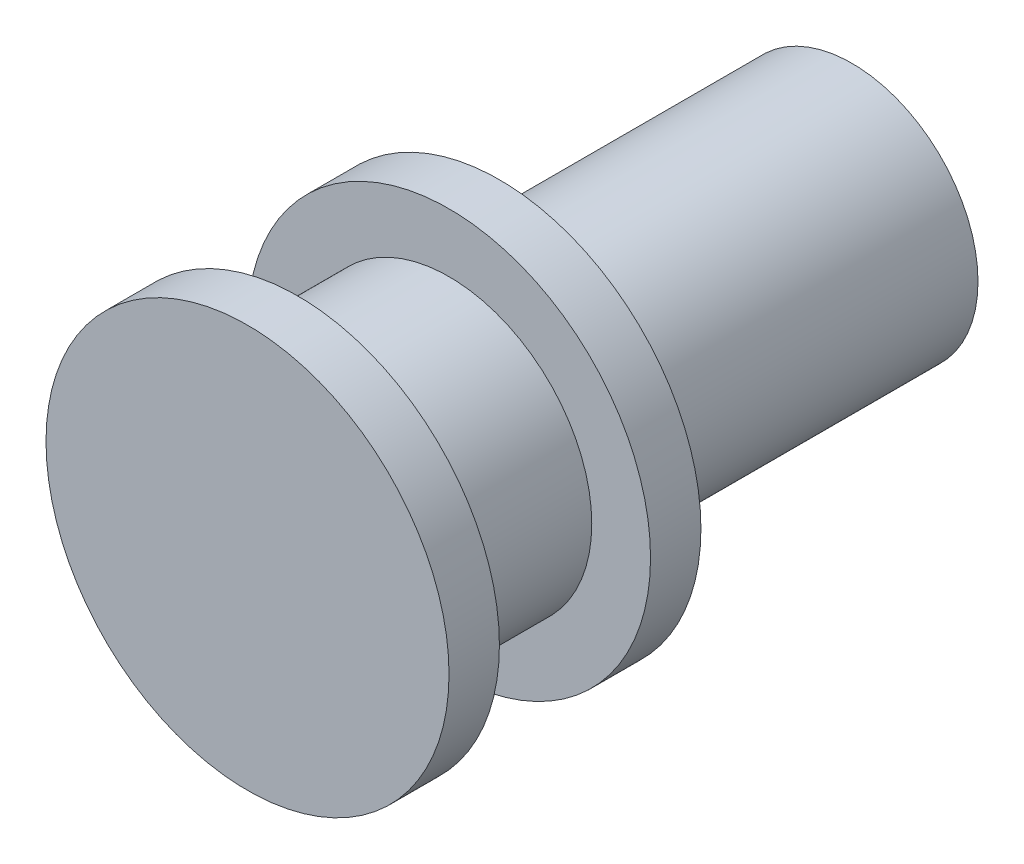
ISO-10303-21;
HEADER;
FILE_DESCRIPTION(('STEP AP214'),'2;1');
FILE_NAME('part.step','',(''),(''),'','','');
FILE_SCHEMA(('AUTOMOTIVE_DESIGN { 1 0 10303 214 1 1 1 1 }'));
ENDSEC;
DATA;
#1=APPLICATION_CONTEXT('core data for automotive mechanical design processes');
#2=APPLICATION_PROTOCOL_DEFINITION('international standard','automotive_design',2000,#1);
#3=PRODUCT_CONTEXT('',#1,'mechanical');
#4=PRODUCT('Part','Part','',(#3));
#5=PRODUCT_RELATED_PRODUCT_CATEGORY('part','',(#4));
#6=PRODUCT_DEFINITION_FORMATION('','',#4);
#7=PRODUCT_DEFINITION_CONTEXT('part definition',#1,'design');
#8=PRODUCT_DEFINITION('design','',#6,#7);
#9=PRODUCT_DEFINITION_SHAPE('','',#8);
#10=(LENGTH_UNIT() NAMED_UNIT(*) SI_UNIT(.MILLI.,.METRE.));
#11=(NAMED_UNIT(*) PLANE_ANGLE_UNIT() SI_UNIT($,.RADIAN.));
#12=(NAMED_UNIT(*) SI_UNIT($,.STERADIAN.) SOLID_ANGLE_UNIT());
#13=UNCERTAINTY_MEASURE_WITH_UNIT(LENGTH_MEASURE(1.E-05),#10,'distance_accuracy_value','');
#14=(GEOMETRIC_REPRESENTATION_CONTEXT(3) GLOBAL_UNCERTAINTY_ASSIGNED_CONTEXT((#13)) GLOBAL_UNIT_ASSIGNED_CONTEXT((#10,
#11,#12)) REPRESENTATION_CONTEXT('',''));
#15=CARTESIAN_POINT('',(0.,0.,0.));
#16=DIRECTION('',(0.,0.,1.));
#17=DIRECTION('',(1.,0.,0.));
#18=AXIS2_PLACEMENT_3D('',#15,#16,#17);
#19=CARTESIAN_POINT('',(0.,0.,0.));
#20=DIRECTION('',(0.,0.,-1.));
#21=DIRECTION('',(-1.,0.,0.));
#22=AXIS2_PLACEMENT_3D('',#19,#20,#21);
#23=PLANE('',#22);
#24=CARTESIAN_POINT('',(0.,0.,0.));
#25=DIRECTION('',(0.,0.,1.));
#26=DIRECTION('',(1.,0.,0.));
#27=AXIS2_PLACEMENT_3D('',#24,#25,#26);
#28=CIRCLE('',#27,3.048);
#29=CARTESIAN_POINT('',(3.048,0.,0.));
#30=VERTEX_POINT('',#29);
#31=EDGE_CURVE('E10',#30,#30,#28,.T.);
#32=ORIENTED_EDGE('',*,*,#31,.T.);
#33=EDGE_LOOP('',(#32));
#34=FACE_BOUND('',#33,.T.);
#35=ADVANCED_FACE('F35',(#34),#23,.F.);
#36=CARTESIAN_POINT('',(0.,0.,2.45094512195122));
#37=DIRECTION('',(0.,0.,1.));
#38=DIRECTION('',(1.,0.,0.));
#39=AXIS2_PLACEMENT_3D('',#36,#37,#38);
#40=CYLINDRICAL_SURFACE('',#39,3.048);
#41=ORIENTED_EDGE('',*,*,#31,.F.);
#42=EDGE_LOOP('',(#41));
#43=FACE_BOUND('',#42,.T.);
#44=CARTESIAN_POINT('',(0.,0.,-0.762));
#45=DIRECTION('',(0.,0.,1.));
#46=DIRECTION('',(1.,0.,0.));
#47=AXIS2_PLACEMENT_3D('',#44,#45,#46);
#48=CIRCLE('',#47,3.048);
#49=CARTESIAN_POINT('',(3.048,0.,-0.762));
#50=VERTEX_POINT('',#49);
#51=EDGE_CURVE('E41',#50,#50,#48,.T.);
#52=ORIENTED_EDGE('',*,*,#51,.T.);
#53=EDGE_LOOP('',(#52));
#54=FACE_BOUND('',#53,.T.);
#55=ADVANCED_FACE('F79',(#43,#54),#40,.T.);
#56=CARTESIAN_POINT('',(0.,3.048,-0.762));
#57=DIRECTION('',(0.,0.,1.));
#58=DIRECTION('',(1.,0.,0.));
#59=AXIS2_PLACEMENT_3D('',#56,#57,#58);
#60=PLANE('',#59);
#61=ORIENTED_EDGE('',*,*,#51,.F.);
#62=EDGE_LOOP('',(#61));
#63=FACE_BOUND('',#62,.T.);
#64=CARTESIAN_POINT('',(0.,0.,-0.762));
#65=DIRECTION('',(0.,0.,1.));
#66=DIRECTION('',(1.,0.,0.));
#67=AXIS2_PLACEMENT_3D('',#64,#65,#66);
#68=CIRCLE('',#67,2.159);
#69=CARTESIAN_POINT('',(2.159,0.,-0.762));
#70=VERTEX_POINT('',#69);
#71=EDGE_CURVE('E45',#70,#70,#68,.T.);
#72=ORIENTED_EDGE('',*,*,#71,.T.);
#73=EDGE_LOOP('',(#72));
#74=FACE_BOUND('',#73,.T.);
#75=ADVANCED_FACE('F83',(#63,#74),#60,.F.);
#76=CARTESIAN_POINT('',(0.,0.,2.45094512195122));
#77=DIRECTION('',(0.,0.,1.));
#78=DIRECTION('',(1.,0.,0.));
#79=AXIS2_PLACEMENT_3D('',#76,#77,#78);
#80=CYLINDRICAL_SURFACE('',#79,2.159);
#81=ORIENTED_EDGE('',*,*,#71,.F.);
#82=EDGE_LOOP('',(#81));
#83=FACE_BOUND('',#82,.T.);
#84=CARTESIAN_POINT('',(0.,0.,-3.048));
#85=DIRECTION('',(0.,0.,1.));
#86=DIRECTION('',(1.,0.,0.));
#87=AXIS2_PLACEMENT_3D('',#84,#85,#86);
#88=CIRCLE('',#87,2.159);
#89=CARTESIAN_POINT('',(2.159,0.,-3.048));
#90=VERTEX_POINT('',#89);
#91=EDGE_CURVE('E49',#90,#90,#88,.T.);
#92=ORIENTED_EDGE('',*,*,#91,.T.);
#93=EDGE_LOOP('',(#92));
#94=FACE_BOUND('',#93,.T.);
#95=ADVANCED_FACE('F88',(#83,#94),#80,.T.);
#96=CARTESIAN_POINT('',(0.,2.159,-3.048));
#97=DIRECTION('',(0.,0.,-1.));
#98=DIRECTION('',(-1.,0.,0.));
#99=AXIS2_PLACEMENT_3D('',#96,#97,#98);
#100=PLANE('',#99);
#101=ORIENTED_EDGE('',*,*,#91,.F.);
#102=EDGE_LOOP('',(#101));
#103=FACE_BOUND('',#102,.T.);
#104=CARTESIAN_POINT('',(0.,0.,-3.048));
#105=DIRECTION('',(0.,0.,1.));
#106=DIRECTION('',(1.,0.,0.));
#107=AXIS2_PLACEMENT_3D('',#104,#105,#106);
#108=CIRCLE('',#107,3.048);
#109=CARTESIAN_POINT('',(3.048,0.,-3.048));
#110=VERTEX_POINT('',#109);
#111=EDGE_CURVE('E54',#110,#110,#108,.T.);
#112=ORIENTED_EDGE('',*,*,#111,.T.);
#113=EDGE_LOOP('',(#112));
#114=FACE_BOUND('',#113,.T.);
#115=ADVANCED_FACE('F94',(#103,#114),#100,.F.);
#116=CARTESIAN_POINT('',(0.,0.,2.45094512195122));
#117=DIRECTION('',(0.,0.,1.));
#118=DIRECTION('',(1.,0.,0.));
#119=AXIS2_PLACEMENT_3D('',#116,#117,#118);
#120=CYLINDRICAL_SURFACE('',#119,3.048);
#121=ORIENTED_EDGE('',*,*,#111,.F.);
#122=EDGE_LOOP('',(#121));
#123=FACE_BOUND('',#122,.T.);
#124=CARTESIAN_POINT('',(0.,0.,-3.81));
#125=DIRECTION('',(0.,0.,1.));
#126=DIRECTION('',(1.,0.,0.));
#127=AXIS2_PLACEMENT_3D('',#124,#125,#126);
#128=CIRCLE('',#127,3.048);
#129=CARTESIAN_POINT('',(3.048,0.,-3.81));
#130=VERTEX_POINT('',#129);
#131=EDGE_CURVE('E57',#130,#130,#128,.T.);
#132=ORIENTED_EDGE('',*,*,#131,.T.);
#133=EDGE_LOOP('',(#132));
#134=FACE_BOUND('',#133,.T.);
#135=ADVANCED_FACE('F98',(#123,#134),#120,.T.);
#136=CARTESIAN_POINT('',(0.,3.048,-3.81));
#137=DIRECTION('',(0.,0.,1.));
#138=DIRECTION('',(1.,0.,0.));
#139=AXIS2_PLACEMENT_3D('',#136,#137,#138);
#140=PLANE('',#139);
#141=ORIENTED_EDGE('',*,*,#131,.F.);
#142=EDGE_LOOP('',(#141));
#143=FACE_BOUND('',#142,.T.);
#144=CARTESIAN_POINT('',(0.,0.,-3.81));
#145=DIRECTION('',(0.,0.,1.));
#146=DIRECTION('',(1.,0.,0.));
#147=AXIS2_PLACEMENT_3D('',#144,#145,#146);
#148=CIRCLE('',#147,1.905);
#149=CARTESIAN_POINT('',(1.905,0.,-3.81));
#150=VERTEX_POINT('',#149);
#151=EDGE_CURVE('E60',#150,#150,#148,.T.);
#152=ORIENTED_EDGE('',*,*,#151,.T.);
#153=EDGE_LOOP('',(#152));
#154=FACE_BOUND('',#153,.T.);
#155=ADVANCED_FACE('F75',(#143,#154),#140,.F.);
#156=CARTESIAN_POINT('',(0.,0.,2.45094512195122));
#157=DIRECTION('',(0.,0.,1.));
#158=DIRECTION('',(1.,0.,0.));
#159=AXIS2_PLACEMENT_3D('',#156,#157,#158);
#160=CYLINDRICAL_SURFACE('',#159,1.905);
#161=ORIENTED_EDGE('',*,*,#151,.F.);
#162=EDGE_LOOP('',(#161));
#163=FACE_BOUND('',#162,.T.);
#164=CARTESIAN_POINT('',(0.,0.,-9.144));
#165=DIRECTION('',(0.,0.,1.));
#166=DIRECTION('',(1.,0.,0.));
#167=AXIS2_PLACEMENT_3D('',#164,#165,#166);
#168=CIRCLE('',#167,1.905);
#169=CARTESIAN_POINT('',(1.905,0.,-9.144));
#170=VERTEX_POINT('',#169);
#171=EDGE_CURVE('E63',#170,#170,#168,.T.);
#172=ORIENTED_EDGE('',*,*,#171,.T.);
#173=EDGE_LOOP('',(#172));
#174=FACE_BOUND('',#173,.T.);
#175=ADVANCED_FACE('F67',(#163,#174),#160,.T.);
#176=CARTESIAN_POINT('',(0.,1.905,-9.144));
#177=DIRECTION('',(0.,0.,1.));
#178=DIRECTION('',(1.,0.,0.));
#179=AXIS2_PLACEMENT_3D('',#176,#177,#178);
#180=PLANE('',#179);
#181=ORIENTED_EDGE('',*,*,#171,.F.);
#182=EDGE_LOOP('',(#181));
#183=FACE_BOUND('',#182,.T.);
#184=ADVANCED_FACE('F69',(#183),#180,.F.);
#185=CLOSED_SHELL('',(#35,#55,#75,#95,#115,#135,#155,#175,#184));
#186=MANIFOLD_SOLID_BREP('B2',#185);
#187=ADVANCED_BREP_SHAPE_REPRESENTATION('',(#18,#186),#14);
#188=SHAPE_DEFINITION_REPRESENTATION(#9,#187);
ENDSEC;
END-ISO-10303-21;
